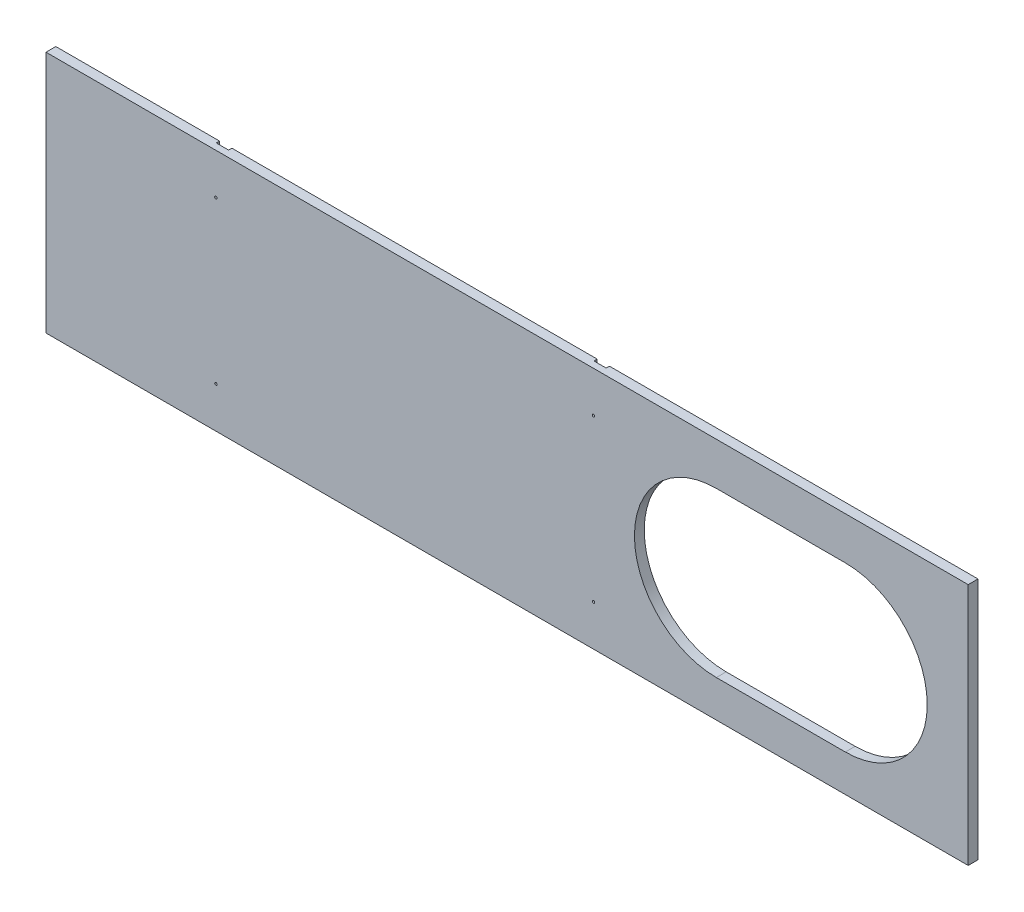
ISO-10303-21;
HEADER;
FILE_DESCRIPTION(('STEP AP214'),'2;1');
FILE_NAME('part.step','',(''),(''),'','','');
FILE_SCHEMA(('AUTOMOTIVE_DESIGN { 1 0 10303 214 1 1 1 1 }'));
ENDSEC;
DATA;
#1=APPLICATION_CONTEXT('core data for automotive mechanical design processes');
#2=APPLICATION_PROTOCOL_DEFINITION('international standard','automotive_design',2000,#1);
#3=PRODUCT_CONTEXT('',#1,'mechanical');
#4=PRODUCT('Part','Part','',(#3));
#5=PRODUCT_RELATED_PRODUCT_CATEGORY('part','',(#4));
#6=PRODUCT_DEFINITION_FORMATION('','',#4);
#7=PRODUCT_DEFINITION_CONTEXT('part definition',#1,'design');
#8=PRODUCT_DEFINITION('design','',#6,#7);
#9=PRODUCT_DEFINITION_SHAPE('','',#8);
#10=(LENGTH_UNIT() NAMED_UNIT(*) SI_UNIT(.MILLI.,.METRE.));
#11=(NAMED_UNIT(*) PLANE_ANGLE_UNIT() SI_UNIT($,.RADIAN.));
#12=(NAMED_UNIT(*) SI_UNIT($,.STERADIAN.) SOLID_ANGLE_UNIT());
#13=UNCERTAINTY_MEASURE_WITH_UNIT(LENGTH_MEASURE(1.E-05),#10,'distance_accuracy_value','');
#14=(GEOMETRIC_REPRESENTATION_CONTEXT(3) GLOBAL_UNCERTAINTY_ASSIGNED_CONTEXT((#13)) GLOBAL_UNIT_ASSIGNED_CONTEXT((#10,
#11,#12)) REPRESENTATION_CONTEXT('',''));
#15=CARTESIAN_POINT('',(0.,0.,0.));
#16=DIRECTION('',(0.,0.,1.));
#17=DIRECTION('',(1.,0.,0.));
#18=AXIS2_PLACEMENT_3D('',#15,#16,#17);
#19=CARTESIAN_POINT('',(0.,0.,0.));
#20=DIRECTION('',(0.,0.,-1.));
#21=DIRECTION('',(-1.,0.,0.));
#22=AXIS2_PLACEMENT_3D('',#19,#20,#21);
#23=PLANE('',#22);
#24=DIRECTION('',(0.,1.,0.));
#25=VECTOR('',#24,1.);
#26=CARTESIAN_POINT('',(-363.,426.840503402116,0.));
#27=LINE('',#26,#25);
#28=CARTESIAN_POINT('',(-363.,-148.5,0.));
#29=VERTEX_POINT('',#28);
#30=CARTESIAN_POINT('',(-363.,148.5,0.));
#31=VERTEX_POINT('',#30);
#32=EDGE_CURVE('E148',#29,#31,#27,.T.);
#33=ORIENTED_EDGE('',*,*,#32,.F.);
#34=DIRECTION('',(1.,0.,0.));
#35=VECTOR('',#34,1.);
#36=CARTESIAN_POINT('',(-563.,-148.5,0.));
#37=LINE('',#36,#35);
#38=CARTESIAN_POINT('',(-563.,-148.5,0.));
#39=VERTEX_POINT('',#38);
#40=EDGE_CURVE('E159',#39,#29,#37,.T.);
#41=ORIENTED_EDGE('',*,*,#40,.F.);
#42=DIRECTION('',(0.,-1.,0.));
#43=VECTOR('',#42,1.);
#44=CARTESIAN_POINT('',(-563.,-148.5,0.));
#45=LINE('',#44,#43);
#46=CARTESIAN_POINT('',(-563.,148.5,0.));
#47=VERTEX_POINT('',#46);
#48=EDGE_CURVE('E177',#47,#39,#45,.T.);
#49=ORIENTED_EDGE('',*,*,#48,.F.);
#50=DIRECTION('',(-1.,0.,0.));
#51=VECTOR('',#50,1.);
#52=CARTESIAN_POINT('',(-563.,148.5,0.));
#53=LINE('',#52,#51);
#54=EDGE_CURVE('E160',#31,#47,#53,.T.);
#55=ORIENTED_EDGE('',*,*,#54,.F.);
#56=EDGE_LOOP('',(#33,#41,#49,#55));
#57=FACE_BOUND('',#56,.T.);
#58=ADVANCED_FACE('F34',(#57),#23,.T.);
#59=CARTESIAN_POINT('',(-355.5,98.5,12.));
#60=DIRECTION('',(0.,0.,-1.));
#61=DIRECTION('',(-1.,0.,0.));
#62=AXIS2_PLACEMENT_3D('',#59,#60,#61);
#63=CYLINDRICAL_SURFACE('',#62,1.50000000000002);
#64=CARTESIAN_POINT('',(-355.5,98.5,12.));
#65=DIRECTION('',(0.,0.,1.));
#66=DIRECTION('',(1.,0.,0.));
#67=AXIS2_PLACEMENT_3D('',#64,#65,#66);
#68=CIRCLE('',#67,1.50000000000002);
#69=CARTESIAN_POINT('',(-354.,98.5,12.));
#70=VERTEX_POINT('',#69);
#71=EDGE_CURVE('E204',#70,#70,#68,.T.);
#72=ORIENTED_EDGE('',*,*,#71,.T.);
#73=EDGE_LOOP('',(#72));
#74=FACE_BOUND('',#73,.T.);
#75=CARTESIAN_POINT('',(-355.5,98.5,4.));
#76=DIRECTION('',(0.,0.,-1.));
#77=DIRECTION('',(-1.,0.,0.));
#78=AXIS2_PLACEMENT_3D('',#75,#76,#77);
#79=CIRCLE('',#78,1.50000000000002);
#80=CARTESIAN_POINT('',(-357.,98.5,4.));
#81=VERTEX_POINT('',#80);
#82=EDGE_CURVE('E272',#81,#81,#79,.T.);
#83=ORIENTED_EDGE('',*,*,#82,.T.);
#84=EDGE_LOOP('',(#83));
#85=FACE_BOUND('',#84,.T.);
#86=ADVANCED_FACE('F319',(#74,#85),#63,.F.);
#87=CARTESIAN_POINT('',(-355.5,-98.5,12.));
#88=DIRECTION('',(0.,0.,-1.));
#89=DIRECTION('',(-1.,0.,0.));
#90=AXIS2_PLACEMENT_3D('',#87,#88,#89);
#91=CYLINDRICAL_SURFACE('',#90,1.50000000000002);
#92=CARTESIAN_POINT('',(-355.5,-98.5,12.));
#93=DIRECTION('',(0.,0.,1.));
#94=DIRECTION('',(1.,0.,0.));
#95=AXIS2_PLACEMENT_3D('',#92,#93,#94);
#96=CIRCLE('',#95,1.50000000000002);
#97=CARTESIAN_POINT('',(-354.,-98.5,12.));
#98=VERTEX_POINT('',#97);
#99=EDGE_CURVE('E207',#98,#98,#96,.T.);
#100=ORIENTED_EDGE('',*,*,#99,.T.);
#101=EDGE_LOOP('',(#100));
#102=FACE_BOUND('',#101,.T.);
#103=CARTESIAN_POINT('',(-355.5,-98.5,4.));
#104=DIRECTION('',(0.,0.,-1.));
#105=DIRECTION('',(-1.,0.,0.));
#106=AXIS2_PLACEMENT_3D('',#103,#104,#105);
#107=CIRCLE('',#106,1.50000000000002);
#108=CARTESIAN_POINT('',(-357.,-98.5,4.));
#109=VERTEX_POINT('',#108);
#110=EDGE_CURVE('E275',#109,#109,#107,.T.);
#111=ORIENTED_EDGE('',*,*,#110,.T.);
#112=EDGE_LOOP('',(#111));
#113=FACE_BOUND('',#112,.T.);
#114=ADVANCED_FACE('F308',(#102,#113),#91,.F.);
#115=DIRECTION('',(0.,-1.,0.));
#116=VECTOR('',#115,1.);
#117=CARTESIAN_POINT('',(-348.,426.840503402116,0.));
#118=LINE('',#117,#116);
#119=CARTESIAN_POINT('',(-348.,148.5,0.));
#120=VERTEX_POINT('',#119);
#121=CARTESIAN_POINT('',(-348.,-148.5,0.));
#122=VERTEX_POINT('',#121);
#123=EDGE_CURVE('E161',#120,#122,#118,.T.);
#124=ORIENTED_EDGE('',*,*,#123,.F.);
#125=CARTESIAN_POINT('',(98.,148.5,0.));
#126=VERTEX_POINT('',#125);
#127=EDGE_CURVE('E186',#126,#120,#53,.T.);
#128=ORIENTED_EDGE('',*,*,#127,.F.);
#129=DIRECTION('',(0.,1.,0.));
#130=VECTOR('',#129,1.);
#131=CARTESIAN_POINT('',(98.0000000000001,437.779887018803,0.));
#132=LINE('',#131,#130);
#133=CARTESIAN_POINT('',(98.,-148.5,0.));
#134=VERTEX_POINT('',#133);
#135=EDGE_CURVE('E258',#134,#126,#132,.T.);
#136=ORIENTED_EDGE('',*,*,#135,.F.);
#137=EDGE_CURVE('E169',#122,#134,#37,.T.);
#138=ORIENTED_EDGE('',*,*,#137,.F.);
#139=EDGE_LOOP('',(#124,#128,#136,#138));
#140=FACE_BOUND('',#139,.T.);
#141=ADVANCED_FACE('F290',(#140),#23,.T.);
#142=CARTESIAN_POINT('',(105.5,98.5,12.));
#143=DIRECTION('',(0.,0.,-1.));
#144=DIRECTION('',(-1.,0.,0.));
#145=AXIS2_PLACEMENT_3D('',#142,#143,#144);
#146=CYLINDRICAL_SURFACE('',#145,1.5);
#147=CARTESIAN_POINT('',(105.5,98.5,12.));
#148=DIRECTION('',(0.,0.,1.));
#149=DIRECTION('',(1.,0.,0.));
#150=AXIS2_PLACEMENT_3D('',#147,#148,#149);
#151=CIRCLE('',#150,1.5);
#152=CARTESIAN_POINT('',(107.,98.5,12.));
#153=VERTEX_POINT('',#152);
#154=EDGE_CURVE('E192',#153,#153,#151,.T.);
#155=ORIENTED_EDGE('',*,*,#154,.T.);
#156=EDGE_LOOP('',(#155));
#157=FACE_BOUND('',#156,.T.);
#158=CARTESIAN_POINT('',(105.5,98.5,4.));
#159=DIRECTION('',(0.,0.,-1.));
#160=DIRECTION('',(-1.,0.,0.));
#161=AXIS2_PLACEMENT_3D('',#158,#159,#160);
#162=CIRCLE('',#161,1.5);
#163=CARTESIAN_POINT('',(104.,98.5,4.));
#164=VERTEX_POINT('',#163);
#165=EDGE_CURVE('E251',#164,#164,#162,.T.);
#166=ORIENTED_EDGE('',*,*,#165,.T.);
#167=EDGE_LOOP('',(#166));
#168=FACE_BOUND('',#167,.T.);
#169=ADVANCED_FACE('F330',(#157,#168),#146,.F.);
#170=CARTESIAN_POINT('',(105.5,-98.5,12.));
#171=DIRECTION('',(0.,0.,-1.));
#172=DIRECTION('',(-1.,0.,0.));
#173=AXIS2_PLACEMENT_3D('',#170,#171,#172);
#174=CYLINDRICAL_SURFACE('',#173,1.5);
#175=CARTESIAN_POINT('',(105.5,-98.5,12.));
#176=DIRECTION('',(0.,0.,1.));
#177=DIRECTION('',(1.,0.,0.));
#178=AXIS2_PLACEMENT_3D('',#175,#176,#177);
#179=CIRCLE('',#178,1.5);
#180=CARTESIAN_POINT('',(107.,-98.5,12.));
#181=VERTEX_POINT('',#180);
#182=EDGE_CURVE('E201',#181,#181,#179,.T.);
#183=ORIENTED_EDGE('',*,*,#182,.T.);
#184=EDGE_LOOP('',(#183));
#185=FACE_BOUND('',#184,.T.);
#186=CARTESIAN_POINT('',(105.5,-98.5,4.));
#187=DIRECTION('',(0.,0.,-1.));
#188=DIRECTION('',(-1.,0.,0.));
#189=AXIS2_PLACEMENT_3D('',#186,#187,#188);
#190=CIRCLE('',#189,1.5);
#191=CARTESIAN_POINT('',(104.,-98.5,4.));
#192=VERTEX_POINT('',#191);
#193=EDGE_CURVE('E254',#192,#192,#190,.T.);
#194=ORIENTED_EDGE('',*,*,#193,.T.);
#195=EDGE_LOOP('',(#194));
#196=FACE_BOUND('',#195,.T.);
#197=ADVANCED_FACE('F339',(#185,#196),#174,.F.);
#198=CARTESIAN_POINT('',(0.,0.,12.));
#199=DIRECTION('',(0.,0.,-1.));
#200=DIRECTION('',(-1.,0.,0.));
#201=AXIS2_PLACEMENT_3D('',#198,#199,#200);
#202=PLANE('',#201);
#203=ORIENTED_EDGE('',*,*,#99,.F.);
#204=EDGE_LOOP('',(#203));
#205=FACE_BOUND('',#204,.T.);
#206=ORIENTED_EDGE('',*,*,#182,.F.);
#207=EDGE_LOOP('',(#206));
#208=FACE_BOUND('',#207,.T.);
#209=DIRECTION('',(0.,1.,0.));
#210=VECTOR('',#209,1.);
#211=CARTESIAN_POINT('',(563.,-148.5,12.));
#212=LINE('',#211,#210);
#213=CARTESIAN_POINT('',(563.,-148.5,12.));
#214=VERTEX_POINT('',#213);
#215=CARTESIAN_POINT('',(563.,148.5,12.));
#216=VERTEX_POINT('',#215);
#217=EDGE_CURVE('E168',#214,#216,#212,.T.);
#218=ORIENTED_EDGE('',*,*,#217,.T.);
#219=DIRECTION('',(-1.,0.,0.));
#220=VECTOR('',#219,1.);
#221=CARTESIAN_POINT('',(-563.,148.5,12.));
#222=LINE('',#221,#220);
#223=CARTESIAN_POINT('',(-563.,148.5,12.));
#224=VERTEX_POINT('',#223);
#225=EDGE_CURVE('E173',#216,#224,#222,.T.);
#226=ORIENTED_EDGE('',*,*,#225,.T.);
#227=DIRECTION('',(0.,-1.,0.));
#228=VECTOR('',#227,1.);
#229=CARTESIAN_POINT('',(-563.,-148.5,12.));
#230=LINE('',#229,#228);
#231=CARTESIAN_POINT('',(-563.,-148.5,12.));
#232=VERTEX_POINT('',#231);
#233=EDGE_CURVE('E196',#224,#232,#230,.T.);
#234=ORIENTED_EDGE('',*,*,#233,.T.);
#235=DIRECTION('',(1.,0.,0.));
#236=VECTOR('',#235,1.);
#237=CARTESIAN_POINT('',(-563.,-148.5,12.));
#238=LINE('',#237,#236);
#239=EDGE_CURVE('E193',#232,#214,#238,.T.);
#240=ORIENTED_EDGE('',*,*,#239,.T.);
#241=EDGE_LOOP('',(#218,#226,#234,#240));
#242=FACE_BOUND('',#241,.T.);
#243=ORIENTED_EDGE('',*,*,#154,.F.);
#244=EDGE_LOOP('',(#243));
#245=FACE_BOUND('',#244,.T.);
#246=ORIENTED_EDGE('',*,*,#71,.F.);
#247=EDGE_LOOP('',(#246));
#248=FACE_BOUND('',#247,.T.);
#249=CARTESIAN_POINT('',(255.5,-3.49999999999998,12.));
#250=DIRECTION('',(0.,0.,1.));
#251=DIRECTION('',(1.,0.,0.));
#252=AXIS2_PLACEMENT_3D('',#249,#250,#251);
#253=CIRCLE('',#252,100.);
#254=CARTESIAN_POINT('',(255.5,96.5,12.));
#255=VERTEX_POINT('',#254);
#256=CARTESIAN_POINT('',(255.5,-103.5,12.));
#257=VERTEX_POINT('',#256);
#258=EDGE_CURVE('E224',#255,#257,#253,.T.);
#259=ORIENTED_EDGE('',*,*,#258,.F.);
#260=DIRECTION('',(-1.,0.,0.));
#261=VECTOR('',#260,1.);
#262=CARTESIAN_POINT('',(255.5,96.5,12.));
#263=LINE('',#262,#261);
#264=CARTESIAN_POINT('',(413.,96.5,12.));
#265=VERTEX_POINT('',#264);
#266=EDGE_CURVE('E220',#265,#255,#263,.T.);
#267=ORIENTED_EDGE('',*,*,#266,.F.);
#268=CARTESIAN_POINT('',(413.,-3.49999999999998,12.));
#269=DIRECTION('',(0.,0.,1.));
#270=DIRECTION('',(1.,0.,0.));
#271=AXIS2_PLACEMENT_3D('',#268,#269,#270);
#272=CIRCLE('',#271,100.);
#273=CARTESIAN_POINT('',(413.,-103.5,12.));
#274=VERTEX_POINT('',#273);
#275=EDGE_CURVE('E236',#274,#265,#272,.T.);
#276=ORIENTED_EDGE('',*,*,#275,.F.);
#277=DIRECTION('',(1.,0.,0.));
#278=VECTOR('',#277,1.);
#279=CARTESIAN_POINT('',(255.5,-103.5,12.));
#280=LINE('',#279,#278);
#281=EDGE_CURVE('E239',#257,#274,#280,.T.);
#282=ORIENTED_EDGE('',*,*,#281,.F.);
#283=EDGE_LOOP('',(#259,#267,#276,#282));
#284=FACE_BOUND('',#283,.T.);
#285=ADVANCED_FACE('F332',(#205,#208,#242,#245,#248,#284),#202,.F.);
#286=DIRECTION('',(0.,-1.,0.));
#287=VECTOR('',#286,1.);
#288=CARTESIAN_POINT('',(113.,437.779887018803,0.));
#289=LINE('',#288,#287);
#290=CARTESIAN_POINT('',(113.,148.5,0.));
#291=VERTEX_POINT('',#290);
#292=CARTESIAN_POINT('',(113.,-148.5,0.));
#293=VERTEX_POINT('',#292);
#294=EDGE_CURVE('E255',#291,#293,#289,.T.);
#295=ORIENTED_EDGE('',*,*,#294,.F.);
#296=CARTESIAN_POINT('',(563.,148.5,0.));
#297=VERTEX_POINT('',#296);
#298=EDGE_CURVE('E182',#297,#291,#53,.T.);
#299=ORIENTED_EDGE('',*,*,#298,.F.);
#300=DIRECTION('',(0.,1.,0.));
#301=VECTOR('',#300,1.);
#302=CARTESIAN_POINT('',(563.,-148.5,0.));
#303=LINE('',#302,#301);
#304=CARTESIAN_POINT('',(563.,-148.5,0.));
#305=VERTEX_POINT('',#304);
#306=EDGE_CURVE('E189',#305,#297,#303,.T.);
#307=ORIENTED_EDGE('',*,*,#306,.F.);
#308=EDGE_CURVE('E171',#293,#305,#37,.T.);
#309=ORIENTED_EDGE('',*,*,#308,.F.);
#310=EDGE_LOOP('',(#295,#299,#307,#309));
#311=FACE_BOUND('',#310,.T.);
#312=DIRECTION('',(-1.,0.,0.));
#313=VECTOR('',#312,1.);
#314=CARTESIAN_POINT('',(255.5,96.5,0.));
#315=LINE('',#314,#313);
#316=CARTESIAN_POINT('',(413.,96.5,0.));
#317=VERTEX_POINT('',#316);
#318=CARTESIAN_POINT('',(255.5,96.5,0.));
#319=VERTEX_POINT('',#318);
#320=EDGE_CURVE('E221',#317,#319,#315,.T.);
#321=ORIENTED_EDGE('',*,*,#320,.T.);
#322=CARTESIAN_POINT('',(255.5,-3.49999999999998,0.));
#323=DIRECTION('',(0.,0.,1.));
#324=DIRECTION('',(1.,0.,0.));
#325=AXIS2_PLACEMENT_3D('',#322,#323,#324);
#326=CIRCLE('',#325,100.);
#327=CARTESIAN_POINT('',(255.5,-103.5,0.));
#328=VERTEX_POINT('',#327);
#329=EDGE_CURVE('E231',#319,#328,#326,.T.);
#330=ORIENTED_EDGE('',*,*,#329,.T.);
#331=DIRECTION('',(1.,0.,0.));
#332=VECTOR('',#331,1.);
#333=CARTESIAN_POINT('',(255.5,-103.5,0.));
#334=LINE('',#333,#332);
#335=CARTESIAN_POINT('',(413.,-103.5,0.));
#336=VERTEX_POINT('',#335);
#337=EDGE_CURVE('E228',#328,#336,#334,.T.);
#338=ORIENTED_EDGE('',*,*,#337,.T.);
#339=CARTESIAN_POINT('',(413.,-3.49999999999998,0.));
#340=DIRECTION('',(0.,0.,1.));
#341=DIRECTION('',(1.,0.,0.));
#342=AXIS2_PLACEMENT_3D('',#339,#340,#341);
#343=CIRCLE('',#342,100.);
#344=EDGE_CURVE('E225',#336,#317,#343,.T.);
#345=ORIENTED_EDGE('',*,*,#344,.T.);
#346=EDGE_LOOP('',(#321,#330,#338,#345));
#347=FACE_BOUND('',#346,.T.);
#348=ADVANCED_FACE('F321',(#311,#347),#23,.T.);
#349=CARTESIAN_POINT('',(563.,-148.5,12.));
#350=DIRECTION('',(-1.,0.,0.));
#351=DIRECTION('',(0.,0.,1.));
#352=AXIS2_PLACEMENT_3D('',#349,#350,#351);
#353=PLANE('',#352);
#354=ORIENTED_EDGE('',*,*,#306,.T.);
#355=DIRECTION('',(0.,0.,-1.));
#356=VECTOR('',#355,1.);
#357=CARTESIAN_POINT('',(563.,148.5,12.));
#358=LINE('',#357,#356);
#359=EDGE_CURVE('E301',#216,#297,#358,.T.);
#360=ORIENTED_EDGE('',*,*,#359,.F.);
#361=ORIENTED_EDGE('',*,*,#217,.F.);
#362=DIRECTION('',(0.,0.,-1.));
#363=VECTOR('',#362,1.);
#364=CARTESIAN_POINT('',(563.,-148.5,12.));
#365=LINE('',#364,#363);
#366=EDGE_CURVE('E195',#214,#305,#365,.T.);
#367=ORIENTED_EDGE('',*,*,#366,.T.);
#368=EDGE_LOOP('',(#354,#360,#361,#367));
#369=FACE_BOUND('',#368,.T.);
#370=ADVANCED_FACE('F36',(#369),#353,.F.);
#371=CARTESIAN_POINT('',(-563.,148.5,12.));
#372=DIRECTION('',(0.,-1.,0.));
#373=DIRECTION('',(0.,0.,-1.));
#374=AXIS2_PLACEMENT_3D('',#371,#372,#373);
#375=PLANE('',#374);
#376=DIRECTION('',(1.,0.,0.));
#377=VECTOR('',#376,1.);
#378=CARTESIAN_POINT('',(-563.,148.5,4.));
#379=LINE('',#378,#377);
#380=CARTESIAN_POINT('',(-363.,148.5,4.));
#381=VERTEX_POINT('',#380);
#382=CARTESIAN_POINT('',(-348.,148.5,4.));
#383=VERTEX_POINT('',#382);
#384=EDGE_CURVE('E268',#381,#383,#379,.T.);
#385=ORIENTED_EDGE('',*,*,#384,.F.);
#386=DIRECTION('',(0.,0.,-1.));
#387=VECTOR('',#386,1.);
#388=CARTESIAN_POINT('',(-363.,148.5,12.));
#389=LINE('',#388,#387);
#390=EDGE_CURVE('E260',#381,#31,#389,.T.);
#391=ORIENTED_EDGE('',*,*,#390,.T.);
#392=ORIENTED_EDGE('',*,*,#54,.T.);
#393=DIRECTION('',(0.,0.,-1.));
#394=VECTOR('',#393,1.);
#395=CARTESIAN_POINT('',(-563.,148.5,12.));
#396=LINE('',#395,#394);
#397=EDGE_CURVE('E400',#224,#47,#396,.T.);
#398=ORIENTED_EDGE('',*,*,#397,.F.);
#399=ORIENTED_EDGE('',*,*,#225,.F.);
#400=ORIENTED_EDGE('',*,*,#359,.T.);
#401=ORIENTED_EDGE('',*,*,#298,.T.);
#402=DIRECTION('',(0.,0.,1.));
#403=VECTOR('',#402,1.);
#404=CARTESIAN_POINT('',(113.,148.5,12.));
#405=LINE('',#404,#403);
#406=CARTESIAN_POINT('',(113.,148.5,4.));
#407=VERTEX_POINT('',#406);
#408=EDGE_CURVE('E244',#291,#407,#405,.T.);
#409=ORIENTED_EDGE('',*,*,#408,.T.);
#410=DIRECTION('',(1.,0.,0.));
#411=VECTOR('',#410,1.);
#412=CARTESIAN_POINT('',(-563.,148.5,4.));
#413=LINE('',#412,#411);
#414=CARTESIAN_POINT('',(98.,148.5,4.));
#415=VERTEX_POINT('',#414);
#416=EDGE_CURVE('E247',#415,#407,#413,.T.);
#417=ORIENTED_EDGE('',*,*,#416,.F.);
#418=DIRECTION('',(0.,0.,-1.));
#419=VECTOR('',#418,1.);
#420=CARTESIAN_POINT('',(98.0000000000001,148.5,12.));
#421=LINE('',#420,#419);
#422=EDGE_CURVE('E234',#415,#126,#421,.T.);
#423=ORIENTED_EDGE('',*,*,#422,.T.);
#424=ORIENTED_EDGE('',*,*,#127,.T.);
#425=DIRECTION('',(0.,0.,1.));
#426=VECTOR('',#425,1.);
#427=CARTESIAN_POINT('',(-348.,148.5,12.));
#428=LINE('',#427,#426);
#429=EDGE_CURVE('E265',#120,#383,#428,.T.);
#430=ORIENTED_EDGE('',*,*,#429,.T.);
#431=EDGE_LOOP('',(#385,#391,#392,#398,#399,#400,#401,#409,#417,#423,#424,#430));
#432=FACE_BOUND('',#431,.T.);
#433=ADVANCED_FACE('F281',(#432),#375,.F.);
#434=CARTESIAN_POINT('',(-563.,-148.5,12.));
#435=DIRECTION('',(1.,0.,0.));
#436=DIRECTION('',(0.,0.,-1.));
#437=AXIS2_PLACEMENT_3D('',#434,#435,#436);
#438=PLANE('',#437);
#439=ORIENTED_EDGE('',*,*,#48,.T.);
#440=DIRECTION('',(0.,0.,-1.));
#441=VECTOR('',#440,1.);
#442=CARTESIAN_POINT('',(-563.,-148.5,12.));
#443=LINE('',#442,#441);
#444=EDGE_CURVE('E167',#232,#39,#443,.T.);
#445=ORIENTED_EDGE('',*,*,#444,.F.);
#446=ORIENTED_EDGE('',*,*,#233,.F.);
#447=ORIENTED_EDGE('',*,*,#397,.T.);
#448=EDGE_LOOP('',(#439,#445,#446,#447));
#449=FACE_BOUND('',#448,.T.);
#450=ADVANCED_FACE('F407',(#449),#438,.F.);
#451=CARTESIAN_POINT('',(-563.,-148.5,12.));
#452=DIRECTION('',(0.,1.,0.));
#453=DIRECTION('',(0.,0.,1.));
#454=AXIS2_PLACEMENT_3D('',#451,#452,#453);
#455=PLANE('',#454);
#456=ORIENTED_EDGE('',*,*,#40,.T.);
#457=DIRECTION('',(0.,0.,1.));
#458=VECTOR('',#457,1.);
#459=CARTESIAN_POINT('',(-363.,-148.5,12.));
#460=LINE('',#459,#458);
#461=CARTESIAN_POINT('',(-363.,-148.5,4.));
#462=VERTEX_POINT('',#461);
#463=EDGE_CURVE('E11',#29,#462,#460,.T.);
#464=ORIENTED_EDGE('',*,*,#463,.T.);
#465=DIRECTION('',(-1.,0.,0.));
#466=VECTOR('',#465,1.);
#467=CARTESIAN_POINT('',(-563.,-148.5,4.));
#468=LINE('',#467,#466);
#469=CARTESIAN_POINT('',(-348.,-148.5,4.));
#470=VERTEX_POINT('',#469);
#471=EDGE_CURVE('E270',#470,#462,#468,.T.);
#472=ORIENTED_EDGE('',*,*,#471,.F.);
#473=DIRECTION('',(0.,0.,-1.));
#474=VECTOR('',#473,1.);
#475=CARTESIAN_POINT('',(-348.,-148.5,12.));
#476=LINE('',#475,#474);
#477=EDGE_CURVE('E42',#470,#122,#476,.T.);
#478=ORIENTED_EDGE('',*,*,#477,.T.);
#479=ORIENTED_EDGE('',*,*,#137,.T.);
#480=DIRECTION('',(0.,0.,1.));
#481=VECTOR('',#480,1.);
#482=CARTESIAN_POINT('',(98.,-148.5,12.));
#483=LINE('',#482,#481);
#484=CARTESIAN_POINT('',(98.,-148.5,4.));
#485=VERTEX_POINT('',#484);
#486=EDGE_CURVE('E295',#134,#485,#483,.T.);
#487=ORIENTED_EDGE('',*,*,#486,.T.);
#488=DIRECTION('',(-1.,0.,0.));
#489=VECTOR('',#488,1.);
#490=CARTESIAN_POINT('',(-563.,-148.5,4.));
#491=LINE('',#490,#489);
#492=CARTESIAN_POINT('',(113.,-148.5,4.));
#493=VERTEX_POINT('',#492);
#494=EDGE_CURVE('E249',#493,#485,#491,.T.);
#495=ORIENTED_EDGE('',*,*,#494,.F.);
#496=DIRECTION('',(0.,0.,-1.));
#497=VECTOR('',#496,1.);
#498=CARTESIAN_POINT('',(113.,-148.5,12.));
#499=LINE('',#498,#497);
#500=EDGE_CURVE('E299',#493,#293,#499,.T.);
#501=ORIENTED_EDGE('',*,*,#500,.T.);
#502=ORIENTED_EDGE('',*,*,#308,.T.);
#503=ORIENTED_EDGE('',*,*,#366,.F.);
#504=ORIENTED_EDGE('',*,*,#239,.F.);
#505=ORIENTED_EDGE('',*,*,#444,.T.);
#506=EDGE_LOOP('',(#456,#464,#472,#478,#479,#487,#495,#501,#502,#503,#504,#505));
#507=FACE_BOUND('',#506,.T.);
#508=ADVANCED_FACE('F164',(#507),#455,.F.);
#509=CARTESIAN_POINT('',(255.5,-3.49999999999998,12.));
#510=DIRECTION('',(0.,0.,-1.));
#511=DIRECTION('',(-1.,0.,0.));
#512=AXIS2_PLACEMENT_3D('',#509,#510,#511);
#513=CYLINDRICAL_SURFACE('',#512,100.);
#514=ORIENTED_EDGE('',*,*,#329,.F.);
#515=DIRECTION('',(0.,0.,-1.));
#516=VECTOR('',#515,1.);
#517=CARTESIAN_POINT('',(255.5,96.5,12.));
#518=LINE('',#517,#516);
#519=EDGE_CURVE('E217',#255,#319,#518,.T.);
#520=ORIENTED_EDGE('',*,*,#519,.F.);
#521=ORIENTED_EDGE('',*,*,#258,.T.);
#522=DIRECTION('',(0.,0.,-1.));
#523=VECTOR('',#522,1.);
#524=CARTESIAN_POINT('',(255.5,-103.5,12.));
#525=LINE('',#524,#523);
#526=EDGE_CURVE('E210',#257,#328,#525,.T.);
#527=ORIENTED_EDGE('',*,*,#526,.T.);
#528=EDGE_LOOP('',(#514,#520,#521,#527));
#529=FACE_BOUND('',#528,.T.);
#530=ADVANCED_FACE('F351',(#529),#513,.F.);
#531=CARTESIAN_POINT('',(255.5,-103.5,12.));
#532=DIRECTION('',(0.,1.,0.));
#533=DIRECTION('',(-1.,0.,0.));
#534=AXIS2_PLACEMENT_3D('',#531,#532,#533);
#535=PLANE('',#534);
#536=ORIENTED_EDGE('',*,*,#337,.F.);
#537=ORIENTED_EDGE('',*,*,#526,.F.);
#538=ORIENTED_EDGE('',*,*,#281,.T.);
#539=DIRECTION('',(0.,0.,-1.));
#540=VECTOR('',#539,1.);
#541=CARTESIAN_POINT('',(413.,-103.5,12.));
#542=LINE('',#541,#540);
#543=EDGE_CURVE('E213',#274,#336,#542,.T.);
#544=ORIENTED_EDGE('',*,*,#543,.T.);
#545=EDGE_LOOP('',(#536,#537,#538,#544));
#546=FACE_BOUND('',#545,.T.);
#547=ADVANCED_FACE('F358',(#546),#535,.T.);
#548=CARTESIAN_POINT('',(413.,-3.49999999999998,12.));
#549=DIRECTION('',(0.,0.,-1.));
#550=DIRECTION('',(-1.,0.,0.));
#551=AXIS2_PLACEMENT_3D('',#548,#549,#550);
#552=CYLINDRICAL_SURFACE('',#551,100.);
#553=ORIENTED_EDGE('',*,*,#344,.F.);
#554=ORIENTED_EDGE('',*,*,#543,.F.);
#555=ORIENTED_EDGE('',*,*,#275,.T.);
#556=DIRECTION('',(0.,0.,-1.));
#557=VECTOR('',#556,1.);
#558=CARTESIAN_POINT('',(413.,96.5,12.));
#559=LINE('',#558,#557);
#560=EDGE_CURVE('E215',#265,#317,#559,.T.);
#561=ORIENTED_EDGE('',*,*,#560,.T.);
#562=EDGE_LOOP('',(#553,#554,#555,#561));
#563=FACE_BOUND('',#562,.T.);
#564=ADVANCED_FACE('F360',(#563),#552,.F.);
#565=CARTESIAN_POINT('',(255.5,96.5,12.));
#566=DIRECTION('',(0.,-1.,0.));
#567=DIRECTION('',(1.,0.,0.));
#568=AXIS2_PLACEMENT_3D('',#565,#566,#567);
#569=PLANE('',#568);
#570=ORIENTED_EDGE('',*,*,#320,.F.);
#571=ORIENTED_EDGE('',*,*,#560,.F.);
#572=ORIENTED_EDGE('',*,*,#266,.T.);
#573=ORIENTED_EDGE('',*,*,#519,.T.);
#574=EDGE_LOOP('',(#570,#571,#572,#573));
#575=FACE_BOUND('',#574,.T.);
#576=ADVANCED_FACE('F346',(#575),#569,.T.);
#577=CARTESIAN_POINT('',(98.0000000000001,437.779887018803,4.));
#578=DIRECTION('',(-1.,0.,0.));
#579=DIRECTION('',(0.,-1.,0.));
#580=AXIS2_PLACEMENT_3D('',#577,#578,#579);
#581=PLANE('',#580);
#582=DIRECTION('',(0.,1.,0.));
#583=VECTOR('',#582,1.);
#584=CARTESIAN_POINT('',(98.0000000000001,437.779887018803,4.));
#585=LINE('',#584,#583);
#586=EDGE_CURVE('E257',#485,#415,#585,.T.);
#587=ORIENTED_EDGE('',*,*,#586,.F.);
#588=ORIENTED_EDGE('',*,*,#486,.F.);
#589=ORIENTED_EDGE('',*,*,#135,.T.);
#590=ORIENTED_EDGE('',*,*,#422,.F.);
#591=EDGE_LOOP('',(#587,#588,#589,#590));
#592=FACE_BOUND('',#591,.T.);
#593=ADVANCED_FACE('F298',(#592),#581,.F.);
#594=CARTESIAN_POINT('',(113.,437.779887018803,4.));
#595=DIRECTION('',(1.,0.,0.));
#596=DIRECTION('',(0.,1.,0.));
#597=AXIS2_PLACEMENT_3D('',#594,#595,#596);
#598=PLANE('',#597);
#599=ORIENTED_EDGE('',*,*,#294,.T.);
#600=ORIENTED_EDGE('',*,*,#500,.F.);
#601=DIRECTION('',(0.,-1.,0.));
#602=VECTOR('',#601,1.);
#603=CARTESIAN_POINT('',(113.,437.779887018803,4.));
#604=LINE('',#603,#602);
#605=EDGE_CURVE('E57',#407,#493,#604,.T.);
#606=ORIENTED_EDGE('',*,*,#605,.F.);
#607=ORIENTED_EDGE('',*,*,#408,.F.);
#608=EDGE_LOOP('',(#599,#600,#606,#607));
#609=FACE_BOUND('',#608,.T.);
#610=ADVANCED_FACE('F390',(#609),#598,.F.);
#611=CARTESIAN_POINT('',(0.,0.,4.));
#612=DIRECTION('',(0.,0.,-1.));
#613=DIRECTION('',(-1.,0.,0.));
#614=AXIS2_PLACEMENT_3D('',#611,#612,#613);
#615=PLANE('',#614);
#616=ORIENTED_EDGE('',*,*,#165,.F.);
#617=EDGE_LOOP('',(#616));
#618=FACE_BOUND('',#617,.T.);
#619=ORIENTED_EDGE('',*,*,#193,.F.);
#620=EDGE_LOOP('',(#619));
#621=FACE_BOUND('',#620,.T.);
#622=ORIENTED_EDGE('',*,*,#416,.T.);
#623=ORIENTED_EDGE('',*,*,#605,.T.);
#624=ORIENTED_EDGE('',*,*,#494,.T.);
#625=ORIENTED_EDGE('',*,*,#586,.T.);
#626=EDGE_LOOP('',(#622,#623,#624,#625));
#627=FACE_BOUND('',#626,.T.);
#628=ADVANCED_FACE('F387',(#618,#621,#627),#615,.T.);
#629=CARTESIAN_POINT('',(-363.,426.840503402116,4.));
#630=DIRECTION('',(-1.,0.,0.));
#631=DIRECTION('',(0.,-1.,0.));
#632=AXIS2_PLACEMENT_3D('',#629,#630,#631);
#633=PLANE('',#632);
#634=DIRECTION('',(0.,1.,0.));
#635=VECTOR('',#634,1.);
#636=CARTESIAN_POINT('',(-363.,426.840503402116,4.));
#637=LINE('',#636,#635);
#638=EDGE_CURVE('E151',#462,#381,#637,.T.);
#639=ORIENTED_EDGE('',*,*,#638,.F.);
#640=ORIENTED_EDGE('',*,*,#463,.F.);
#641=ORIENTED_EDGE('',*,*,#32,.T.);
#642=ORIENTED_EDGE('',*,*,#390,.F.);
#643=EDGE_LOOP('',(#639,#640,#641,#642));
#644=FACE_BOUND('',#643,.T.);
#645=ADVANCED_FACE('F147',(#644),#633,.F.);
#646=CARTESIAN_POINT('',(-348.,426.840503402116,4.));
#647=DIRECTION('',(1.,0.,0.));
#648=DIRECTION('',(0.,1.,0.));
#649=AXIS2_PLACEMENT_3D('',#646,#647,#648);
#650=PLANE('',#649);
#651=ORIENTED_EDGE('',*,*,#123,.T.);
#652=ORIENTED_EDGE('',*,*,#477,.F.);
#653=DIRECTION('',(0.,-1.,0.));
#654=VECTOR('',#653,1.);
#655=CARTESIAN_POINT('',(-348.,426.840503402116,4.));
#656=LINE('',#655,#654);
#657=EDGE_CURVE('E49',#383,#470,#656,.T.);
#658=ORIENTED_EDGE('',*,*,#657,.F.);
#659=ORIENTED_EDGE('',*,*,#429,.F.);
#660=EDGE_LOOP('',(#651,#652,#658,#659));
#661=FACE_BOUND('',#660,.T.);
#662=ADVANCED_FACE('F286',(#661),#650,.F.);
#663=CARTESIAN_POINT('',(0.,0.,4.));
#664=DIRECTION('',(0.,0.,-1.));
#665=DIRECTION('',(-1.,0.,0.));
#666=AXIS2_PLACEMENT_3D('',#663,#664,#665);
#667=PLANE('',#666);
#668=ORIENTED_EDGE('',*,*,#82,.F.);
#669=EDGE_LOOP('',(#668));
#670=FACE_BOUND('',#669,.T.);
#671=ORIENTED_EDGE('',*,*,#110,.F.);
#672=EDGE_LOOP('',(#671));
#673=FACE_BOUND('',#672,.T.);
#674=ORIENTED_EDGE('',*,*,#384,.T.);
#675=ORIENTED_EDGE('',*,*,#657,.T.);
#676=ORIENTED_EDGE('',*,*,#471,.T.);
#677=ORIENTED_EDGE('',*,*,#638,.T.);
#678=EDGE_LOOP('',(#674,#675,#676,#677));
#679=FACE_BOUND('',#678,.T.);
#680=ADVANCED_FACE('F279',(#670,#673,#679),#667,.T.);
#681=CLOSED_SHELL('',(#58,#86,#114,#141,#169,#197,#285,#348,#370,#433,#450,#508,#530,#547,#564,
#576,#593,#610,#628,#645,#662,#680));
#682=MANIFOLD_SOLID_BREP('B2',#681);
#683=ADVANCED_BREP_SHAPE_REPRESENTATION('',(#18,#682),#14);
#684=SHAPE_DEFINITION_REPRESENTATION(#9,#683);
ENDSEC;
END-ISO-10303-21;
